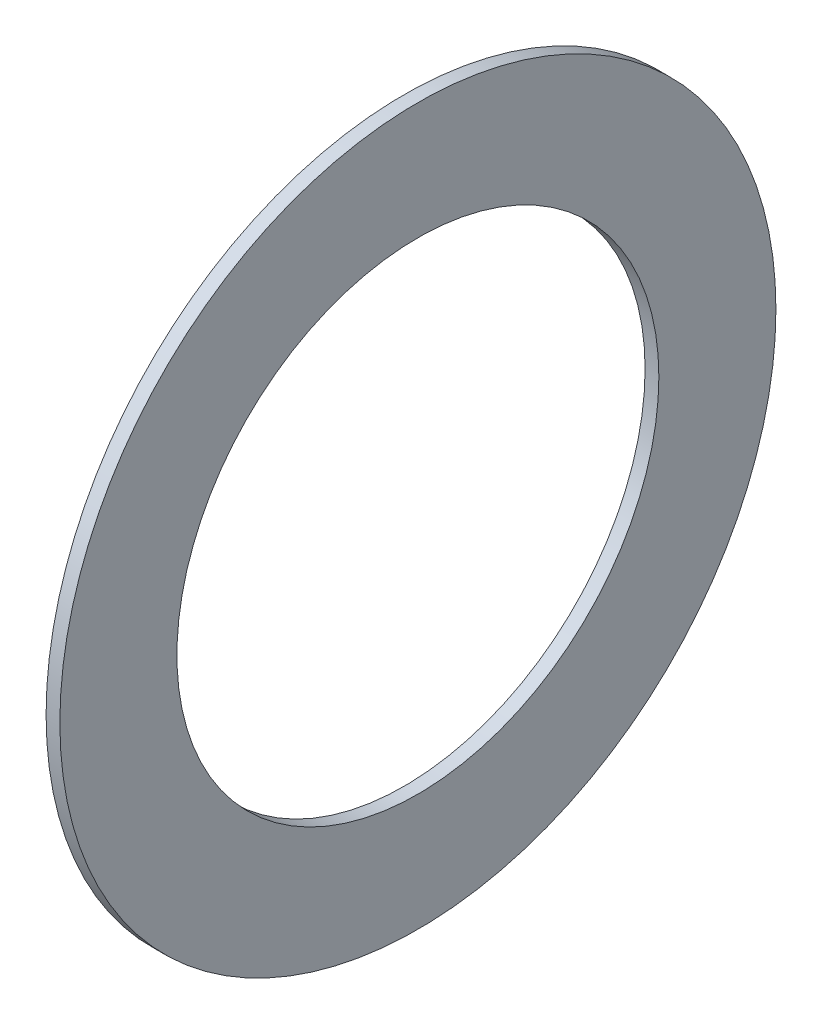
ISO-10303-21;
HEADER;
FILE_DESCRIPTION(('STEP AP214'),'2;1');
FILE_NAME('part.step','',(''),(''),'','','');
FILE_SCHEMA(('AUTOMOTIVE_DESIGN { 1 0 10303 214 1 1 1 1 }'));
ENDSEC;
DATA;
#1=APPLICATION_CONTEXT('core data for automotive mechanical design processes');
#2=APPLICATION_PROTOCOL_DEFINITION('international standard','automotive_design',2000,#1);
#3=PRODUCT_CONTEXT('',#1,'mechanical');
#4=PRODUCT('Part','Part','',(#3));
#5=PRODUCT_RELATED_PRODUCT_CATEGORY('part','',(#4));
#6=PRODUCT_DEFINITION_FORMATION('','',#4);
#7=PRODUCT_DEFINITION_CONTEXT('part definition',#1,'design');
#8=PRODUCT_DEFINITION('design','',#6,#7);
#9=PRODUCT_DEFINITION_SHAPE('','',#8);
#10=(LENGTH_UNIT() NAMED_UNIT(*) SI_UNIT(.MILLI.,.METRE.));
#11=(NAMED_UNIT(*) PLANE_ANGLE_UNIT() SI_UNIT($,.RADIAN.));
#12=(NAMED_UNIT(*) SI_UNIT($,.STERADIAN.) SOLID_ANGLE_UNIT());
#13=UNCERTAINTY_MEASURE_WITH_UNIT(LENGTH_MEASURE(1.E-05),#10,'distance_accuracy_value','');
#14=(GEOMETRIC_REPRESENTATION_CONTEXT(3) GLOBAL_UNCERTAINTY_ASSIGNED_CONTEXT((#13)) GLOBAL_UNIT_ASSIGNED_CONTEXT((#10,
#11,#12)) REPRESENTATION_CONTEXT('',''));
#15=CARTESIAN_POINT('',(0.,0.,0.));
#16=DIRECTION('',(0.,0.,1.));
#17=DIRECTION('',(1.,0.,0.));
#18=AXIS2_PLACEMENT_3D('',#15,#16,#17);
#19=CARTESIAN_POINT('',(1.,0.,0.));
#20=DIRECTION('',(1.,0.,0.));
#21=DIRECTION('',(0.,0.,-1.));
#22=AXIS2_PLACEMENT_3D('',#19,#20,#21);
#23=PLANE('',#22);
#24=CARTESIAN_POINT('',(1.,0.,0.));
#25=DIRECTION('',(1.,0.,0.));
#26=DIRECTION('',(0.,0.,-1.));
#27=AXIS2_PLACEMENT_3D('',#24,#25,#26);
#28=CIRCLE('',#27,26.);
#29=CARTESIAN_POINT('',(1.,0.,-26.));
#30=VERTEX_POINT('',#29);
#31=EDGE_CURVE('E10',#30,#30,#28,.T.);
#32=ORIENTED_EDGE('',*,*,#31,.T.);
#33=EDGE_LOOP('',(#32));
#34=FACE_BOUND('',#33,.T.);
#35=CARTESIAN_POINT('',(1.,0.,0.));
#36=DIRECTION('',(1.,0.,0.));
#37=DIRECTION('',(0.,0.,-1.));
#38=AXIS2_PLACEMENT_3D('',#35,#36,#37);
#39=CIRCLE('',#38,17.5);
#40=CARTESIAN_POINT('',(1.,0.,-17.5));
#41=VERTEX_POINT('',#40);
#42=EDGE_CURVE('E45',#41,#41,#39,.T.);
#43=ORIENTED_EDGE('',*,*,#42,.F.);
#44=EDGE_LOOP('',(#43));
#45=FACE_BOUND('',#44,.T.);
#46=ADVANCED_FACE('F34',(#34,#45),#23,.T.);
#47=CARTESIAN_POINT('',(0.,0.,0.));
#48=DIRECTION('',(1.,0.,0.));
#49=DIRECTION('',(0.,0.,-1.));
#50=AXIS2_PLACEMENT_3D('',#47,#48,#49);
#51=PLANE('',#50);
#52=CARTESIAN_POINT('',(0.,0.,0.));
#53=DIRECTION('',(1.,0.,0.));
#54=DIRECTION('',(0.,0.,-1.));
#55=AXIS2_PLACEMENT_3D('',#52,#53,#54);
#56=CIRCLE('',#55,26.);
#57=CARTESIAN_POINT('',(0.,0.,-26.));
#58=VERTEX_POINT('',#57);
#59=EDGE_CURVE('E38',#58,#58,#56,.T.);
#60=ORIENTED_EDGE('',*,*,#59,.F.);
#61=EDGE_LOOP('',(#60));
#62=FACE_BOUND('',#61,.T.);
#63=CARTESIAN_POINT('',(0.,0.,0.));
#64=DIRECTION('',(1.,0.,0.));
#65=DIRECTION('',(0.,0.,-1.));
#66=AXIS2_PLACEMENT_3D('',#63,#64,#65);
#67=CIRCLE('',#66,17.5);
#68=CARTESIAN_POINT('',(0.,0.,-17.5));
#69=VERTEX_POINT('',#68);
#70=EDGE_CURVE('E47',#69,#69,#67,.T.);
#71=ORIENTED_EDGE('',*,*,#70,.T.);
#72=EDGE_LOOP('',(#71));
#73=FACE_BOUND('',#72,.T.);
#74=ADVANCED_FACE('F57',(#62,#73),#51,.F.);
#75=CARTESIAN_POINT('',(1.,0.,0.));
#76=DIRECTION('',(-1.,0.,0.));
#77=DIRECTION('',(0.,0.,1.));
#78=AXIS2_PLACEMENT_3D('',#75,#76,#77);
#79=CYLINDRICAL_SURFACE('',#78,26.);
#80=ORIENTED_EDGE('',*,*,#31,.F.);
#81=EDGE_LOOP('',(#80));
#82=FACE_BOUND('',#81,.T.);
#83=ORIENTED_EDGE('',*,*,#59,.T.);
#84=EDGE_LOOP('',(#83));
#85=FACE_BOUND('',#84,.T.);
#86=ADVANCED_FACE('F36',(#82,#85),#79,.T.);
#87=CARTESIAN_POINT('',(1.,0.,0.));
#88=DIRECTION('',(-1.,0.,0.));
#89=DIRECTION('',(0.,0.,1.));
#90=AXIS2_PLACEMENT_3D('',#87,#88,#89);
#91=CYLINDRICAL_SURFACE('',#90,17.5);
#92=ORIENTED_EDGE('',*,*,#42,.T.);
#93=EDGE_LOOP('',(#92));
#94=FACE_BOUND('',#93,.T.);
#95=ORIENTED_EDGE('',*,*,#70,.F.);
#96=EDGE_LOOP('',(#95));
#97=FACE_BOUND('',#96,.T.);
#98=ADVANCED_FACE('F53',(#94,#97),#91,.F.);
#99=CLOSED_SHELL('',(#46,#74,#86,#98));
#100=MANIFOLD_SOLID_BREP('B2',#99);
#101=ADVANCED_BREP_SHAPE_REPRESENTATION('',(#18,#100),#14);
#102=SHAPE_DEFINITION_REPRESENTATION(#9,#101);
ENDSEC;
END-ISO-10303-21;
